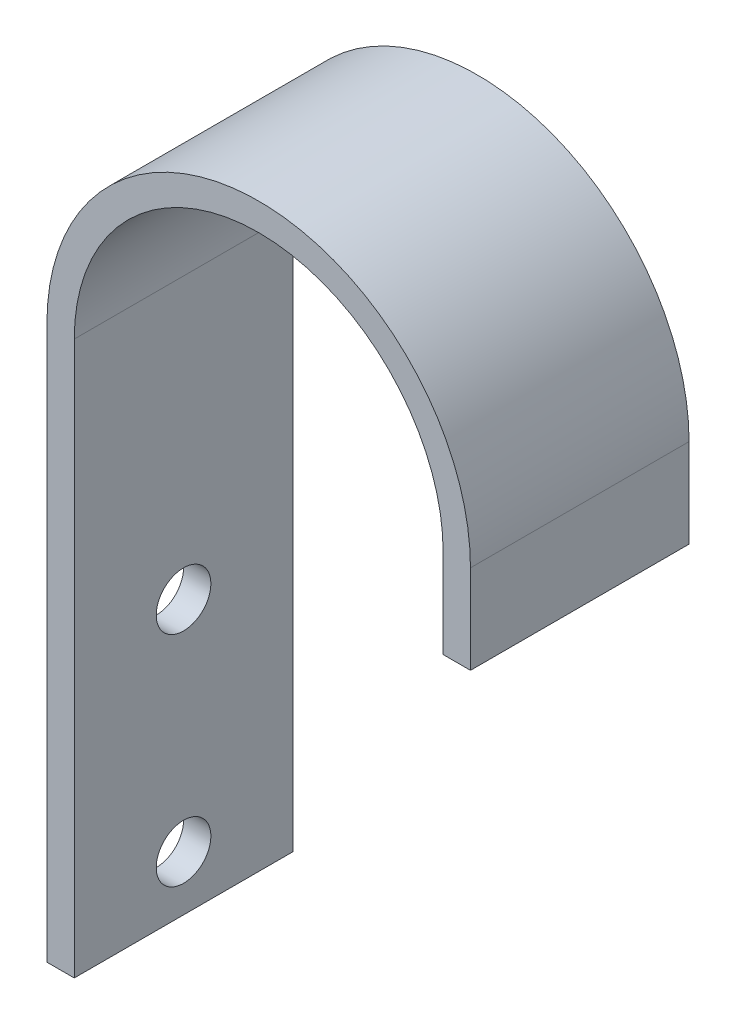
ISO-10303-21;
HEADER;
FILE_DESCRIPTION(('STEP AP214'),'2;1');
FILE_NAME('part.step','',(''),(''),'','','');
FILE_SCHEMA(('AUTOMOTIVE_DESIGN { 1 0 10303 214 1 1 1 1 }'));
ENDSEC;
DATA;
#1=APPLICATION_CONTEXT('core data for automotive mechanical design processes');
#2=APPLICATION_PROTOCOL_DEFINITION('international standard','automotive_design',2000,#1);
#3=PRODUCT_CONTEXT('',#1,'mechanical');
#4=PRODUCT('Part','Part','',(#3));
#5=PRODUCT_RELATED_PRODUCT_CATEGORY('part','',(#4));
#6=PRODUCT_DEFINITION_FORMATION('','',#4);
#7=PRODUCT_DEFINITION_CONTEXT('part definition',#1,'design');
#8=PRODUCT_DEFINITION('design','',#6,#7);
#9=PRODUCT_DEFINITION_SHAPE('','',#8);
#10=(LENGTH_UNIT() NAMED_UNIT(*) SI_UNIT(.MILLI.,.METRE.));
#11=(NAMED_UNIT(*) PLANE_ANGLE_UNIT() SI_UNIT($,.RADIAN.));
#12=(NAMED_UNIT(*) SI_UNIT($,.STERADIAN.) SOLID_ANGLE_UNIT());
#13=UNCERTAINTY_MEASURE_WITH_UNIT(LENGTH_MEASURE(1.E-05),#10,'distance_accuracy_value','');
#14=(GEOMETRIC_REPRESENTATION_CONTEXT(3) GLOBAL_UNCERTAINTY_ASSIGNED_CONTEXT((#13)) GLOBAL_UNIT_ASSIGNED_CONTEXT((#10,
#11,#12)) REPRESENTATION_CONTEXT('',''));
#15=CARTESIAN_POINT('',(0.,0.,0.));
#16=DIRECTION('',(0.,0.,1.));
#17=DIRECTION('',(1.,0.,0.));
#18=AXIS2_PLACEMENT_3D('',#15,#16,#17);
#19=CARTESIAN_POINT('',(-144.426414240362,-31.75,12.7));
#20=DIRECTION('',(1.,0.,0.));
#21=DIRECTION('',(0.,0.,-1.));
#22=AXIS2_PLACEMENT_3D('',#19,#20,#21);
#23=CYLINDRICAL_SURFACE('',#22,3.175);
#24=CARTESIAN_POINT('',(-42.8625,-31.75,12.7));
#25=DIRECTION('',(1.,0.,0.));
#26=DIRECTION('',(0.,0.,-1.));
#27=AXIS2_PLACEMENT_3D('',#24,#25,#26);
#28=CIRCLE('',#27,3.175);
#29=CARTESIAN_POINT('',(-42.8625,-31.75,9.525));
#30=VERTEX_POINT('',#29);
#31=EDGE_CURVE('E142',#30,#30,#28,.T.);
#32=ORIENTED_EDGE('',*,*,#31,.F.);
#33=EDGE_LOOP('',(#32));
#34=FACE_BOUND('',#33,.T.);
#35=CARTESIAN_POINT('',(-39.6875,-31.75,12.7));
#36=DIRECTION('',(1.,0.,0.));
#37=DIRECTION('',(0.,0.,-1.));
#38=AXIS2_PLACEMENT_3D('',#35,#36,#37);
#39=CIRCLE('',#38,3.175);
#40=CARTESIAN_POINT('',(-39.6875,-31.75,9.525));
#41=VERTEX_POINT('',#40);
#42=EDGE_CURVE('E20',#41,#41,#39,.F.);
#43=ORIENTED_EDGE('',*,*,#42,.F.);
#44=EDGE_LOOP('',(#43));
#45=FACE_BOUND('',#44,.T.);
#46=ADVANCED_FACE('F17',(#34,#45),#23,.F.);
#47=CARTESIAN_POINT('',(-144.426414240362,-6.35,12.7));
#48=DIRECTION('',(1.,0.,0.));
#49=DIRECTION('',(0.,0.,-1.));
#50=AXIS2_PLACEMENT_3D('',#47,#48,#49);
#51=CYLINDRICAL_SURFACE('',#50,3.175);
#52=CARTESIAN_POINT('',(-42.8625,-6.35,12.7));
#53=DIRECTION('',(1.,0.,0.));
#54=DIRECTION('',(0.,0.,-1.));
#55=AXIS2_PLACEMENT_3D('',#52,#53,#54);
#56=CIRCLE('',#55,3.175);
#57=CARTESIAN_POINT('',(-42.8625,-6.35,9.525));
#58=VERTEX_POINT('',#57);
#59=EDGE_CURVE('E161',#58,#58,#56,.T.);
#60=ORIENTED_EDGE('',*,*,#59,.F.);
#61=EDGE_LOOP('',(#60));
#62=FACE_BOUND('',#61,.T.);
#63=CARTESIAN_POINT('',(-39.6875,-6.35,12.7));
#64=DIRECTION('',(1.,0.,0.));
#65=DIRECTION('',(0.,0.,-1.));
#66=AXIS2_PLACEMENT_3D('',#63,#64,#65);
#67=CIRCLE('',#66,3.175);
#68=CARTESIAN_POINT('',(-39.6875,-6.35,9.525));
#69=VERTEX_POINT('',#68);
#70=EDGE_CURVE('E130',#69,#69,#67,.F.);
#71=ORIENTED_EDGE('',*,*,#70,.F.);
#72=EDGE_LOOP('',(#71));
#73=FACE_BOUND('',#72,.T.);
#74=ADVANCED_FACE('F175',(#62,#73),#51,.F.);
#75=CARTESIAN_POINT('',(-39.6875,-38.1,0.));
#76=DIRECTION('',(0.,-1.,0.));
#77=DIRECTION('',(0.,0.,-1.));
#78=AXIS2_PLACEMENT_3D('',#75,#76,#77);
#79=PLANE('',#78);
#80=DIRECTION('',(1.,0.,0.));
#81=VECTOR('',#80,1.);
#82=CARTESIAN_POINT('',(-26.533477864469,-38.1,25.4));
#83=LINE('',#82,#81);
#84=CARTESIAN_POINT('',(-42.8625,-38.1,25.4));
#85=VERTEX_POINT('',#84);
#86=CARTESIAN_POINT('',(-39.6875,-38.1,25.4));
#87=VERTEX_POINT('',#86);
#88=EDGE_CURVE('E134',#85,#87,#83,.T.);
#89=ORIENTED_EDGE('',*,*,#88,.F.);
#90=DIRECTION('',(0.,0.,1.));
#91=VECTOR('',#90,1.);
#92=CARTESIAN_POINT('',(-42.8625,-38.1,0.));
#93=LINE('',#92,#91);
#94=CARTESIAN_POINT('',(-42.8625,-38.1,0.));
#95=VERTEX_POINT('',#94);
#96=EDGE_CURVE('E83',#95,#85,#93,.T.);
#97=ORIENTED_EDGE('',*,*,#96,.F.);
#98=DIRECTION('',(1.,0.,0.));
#99=VECTOR('',#98,1.);
#100=CARTESIAN_POINT('',(-26.533477864469,-38.1,0.));
#101=LINE('',#100,#99);
#102=CARTESIAN_POINT('',(-39.6875,-38.1,0.));
#103=VERTEX_POINT('',#102);
#104=EDGE_CURVE('E71',#95,#103,#101,.T.);
#105=ORIENTED_EDGE('',*,*,#104,.T.);
#106=DIRECTION('',(0.,0.,-1.));
#107=VECTOR('',#106,1.);
#108=CARTESIAN_POINT('',(-39.6875,-38.1,0.));
#109=LINE('',#108,#107);
#110=EDGE_CURVE('E77',#87,#103,#109,.T.);
#111=ORIENTED_EDGE('',*,*,#110,.F.);
#112=EDGE_LOOP('',(#89,#97,#105,#111));
#113=FACE_BOUND('',#112,.T.);
#114=ADVANCED_FACE('F181',(#113),#79,.T.);
#115=CARTESIAN_POINT('',(-39.6875,26.19375,0.));
#116=DIRECTION('',(1.,0.,0.));
#117=DIRECTION('',(0.,0.,-1.));
#118=AXIS2_PLACEMENT_3D('',#115,#116,#117);
#119=PLANE('',#118);
#120=ORIENTED_EDGE('',*,*,#70,.T.);
#121=EDGE_LOOP('',(#120));
#122=FACE_BOUND('',#121,.T.);
#123=ORIENTED_EDGE('',*,*,#42,.T.);
#124=EDGE_LOOP('',(#123));
#125=FACE_BOUND('',#124,.T.);
#126=DIRECTION('',(0.,1.,0.));
#127=VECTOR('',#126,1.);
#128=CARTESIAN_POINT('',(-39.6875,17.6760406168869,25.4));
#129=LINE('',#128,#127);
#130=CARTESIAN_POINT('',(-39.6875,26.19375,25.4));
#131=VERTEX_POINT('',#130);
#132=EDGE_CURVE('E137',#87,#131,#129,.T.);
#133=ORIENTED_EDGE('',*,*,#132,.F.);
#134=ORIENTED_EDGE('',*,*,#110,.T.);
#135=DIRECTION('',(0.,1.,0.));
#136=VECTOR('',#135,1.);
#137=CARTESIAN_POINT('',(-39.6875,17.6760406168869,0.));
#138=LINE('',#137,#136);
#139=CARTESIAN_POINT('',(-39.6875,26.19375,0.));
#140=VERTEX_POINT('',#139);
#141=EDGE_CURVE('E61',#103,#140,#138,.T.);
#142=ORIENTED_EDGE('',*,*,#141,.T.);
#143=DIRECTION('',(0.,0.,1.));
#144=VECTOR('',#143,1.);
#145=CARTESIAN_POINT('',(-39.6875,26.19375,0.));
#146=LINE('',#145,#144);
#147=EDGE_CURVE('E128',#140,#131,#146,.T.);
#148=ORIENTED_EDGE('',*,*,#147,.T.);
#149=EDGE_LOOP('',(#133,#134,#142,#148));
#150=FACE_BOUND('',#149,.T.);
#151=ADVANCED_FACE('F172',(#122,#125,#150),#119,.T.);
#152=CARTESIAN_POINT('',(-18.25625,26.19375,0.));
#153=DIRECTION('',(0.,0.,1.));
#154=DIRECTION('',(1.,0.,0.));
#155=AXIS2_PLACEMENT_3D('',#152,#153,#154);
#156=CYLINDRICAL_SURFACE('',#155,21.43125);
#157=CARTESIAN_POINT('',(-18.25625,26.19375,0.));
#158=DIRECTION('',(0.,0.,1.));
#159=DIRECTION('',(1.,0.,0.));
#160=AXIS2_PLACEMENT_3D('',#157,#158,#159);
#161=CIRCLE('',#160,21.43125);
#162=CARTESIAN_POINT('',(3.175,26.19375,0.));
#163=VERTEX_POINT('',#162);
#164=EDGE_CURVE('E105',#140,#163,#161,.F.);
#165=ORIENTED_EDGE('',*,*,#164,.T.);
#166=DIRECTION('',(0.,0.,1.));
#167=VECTOR('',#166,1.);
#168=CARTESIAN_POINT('',(3.175,26.19375,0.));
#169=LINE('',#168,#167);
#170=CARTESIAN_POINT('',(3.175,26.19375,25.4));
#171=VERTEX_POINT('',#170);
#172=EDGE_CURVE('E100',#171,#163,#169,.F.);
#173=ORIENTED_EDGE('',*,*,#172,.F.);
#174=CARTESIAN_POINT('',(-18.25625,26.19375,25.4));
#175=DIRECTION('',(0.,0.,1.));
#176=DIRECTION('',(1.,0.,0.));
#177=AXIS2_PLACEMENT_3D('',#174,#175,#176);
#178=CIRCLE('',#177,21.43125);
#179=EDGE_CURVE('E157',#131,#171,#178,.F.);
#180=ORIENTED_EDGE('',*,*,#179,.F.);
#181=ORIENTED_EDGE('',*,*,#147,.F.);
#182=EDGE_LOOP('',(#165,#173,#180,#181));
#183=FACE_BOUND('',#182,.T.);
#184=ADVANCED_FACE('F208',(#183),#156,.F.);
#185=CARTESIAN_POINT('',(3.175,15.875,0.));
#186=DIRECTION('',(-1.,0.,0.));
#187=DIRECTION('',(0.,0.,1.));
#188=AXIS2_PLACEMENT_3D('',#185,#186,#187);
#189=PLANE('',#188);
#190=DIRECTION('',(0.,1.,0.));
#191=VECTOR('',#190,1.);
#192=CARTESIAN_POINT('',(3.175,17.6760406168869,25.4));
#193=LINE('',#192,#191);
#194=CARTESIAN_POINT('',(3.175,15.875,25.4));
#195=VERTEX_POINT('',#194);
#196=EDGE_CURVE('E160',#171,#195,#193,.F.);
#197=ORIENTED_EDGE('',*,*,#196,.F.);
#198=ORIENTED_EDGE('',*,*,#172,.T.);
#199=DIRECTION('',(0.,1.,0.));
#200=VECTOR('',#199,1.);
#201=CARTESIAN_POINT('',(3.175,17.6760406168869,0.));
#202=LINE('',#201,#200);
#203=CARTESIAN_POINT('',(3.175,15.875,0.));
#204=VERTEX_POINT('',#203);
#205=EDGE_CURVE('E94',#163,#204,#202,.F.);
#206=ORIENTED_EDGE('',*,*,#205,.T.);
#207=DIRECTION('',(0.,0.,-1.));
#208=VECTOR('',#207,1.);
#209=CARTESIAN_POINT('',(3.175,15.875,0.));
#210=LINE('',#209,#208);
#211=EDGE_CURVE('E98',#195,#204,#210,.T.);
#212=ORIENTED_EDGE('',*,*,#211,.F.);
#213=EDGE_LOOP('',(#197,#198,#206,#212));
#214=FACE_BOUND('',#213,.T.);
#215=ADVANCED_FACE('F97',(#214),#189,.T.);
#216=CARTESIAN_POINT('',(6.35,15.875,0.));
#217=DIRECTION('',(0.,-1.,0.));
#218=DIRECTION('',(0.,0.,-1.));
#219=AXIS2_PLACEMENT_3D('',#216,#217,#218);
#220=PLANE('',#219);
#221=DIRECTION('',(1.,0.,0.));
#222=VECTOR('',#221,1.);
#223=CARTESIAN_POINT('',(-26.533477864469,15.875,25.4));
#224=LINE('',#223,#222);
#225=CARTESIAN_POINT('',(6.35,15.875,25.4));
#226=VERTEX_POINT('',#225);
#227=EDGE_CURVE('E111',#195,#226,#224,.T.);
#228=ORIENTED_EDGE('',*,*,#227,.F.);
#229=ORIENTED_EDGE('',*,*,#211,.T.);
#230=DIRECTION('',(1.,0.,0.));
#231=VECTOR('',#230,1.);
#232=CARTESIAN_POINT('',(-26.533477864469,15.875,0.));
#233=LINE('',#232,#231);
#234=CARTESIAN_POINT('',(6.35,15.875,0.));
#235=VERTEX_POINT('',#234);
#236=EDGE_CURVE('E104',#204,#235,#233,.T.);
#237=ORIENTED_EDGE('',*,*,#236,.T.);
#238=DIRECTION('',(0.,0.,-1.));
#239=VECTOR('',#238,1.);
#240=CARTESIAN_POINT('',(6.35,15.875,0.));
#241=LINE('',#240,#239);
#242=EDGE_CURVE('E156',#226,#235,#241,.T.);
#243=ORIENTED_EDGE('',*,*,#242,.F.);
#244=EDGE_LOOP('',(#228,#229,#237,#243));
#245=FACE_BOUND('',#244,.T.);
#246=ADVANCED_FACE('F108',(#245),#220,.T.);
#247=CARTESIAN_POINT('',(-26.533477864469,17.6760406168869,0.));
#248=DIRECTION('',(0.,0.,1.));
#249=DIRECTION('',(1.,0.,0.));
#250=AXIS2_PLACEMENT_3D('',#247,#248,#249);
#251=PLANE('',#250);
#252=DIRECTION('',(0.,1.,0.));
#253=VECTOR('',#252,1.);
#254=CARTESIAN_POINT('',(6.35,26.19375,0.));
#255=LINE('',#254,#253);
#256=CARTESIAN_POINT('',(6.35,26.19375,0.));
#257=VERTEX_POINT('',#256);
#258=EDGE_CURVE('E116',#235,#257,#255,.T.);
#259=ORIENTED_EDGE('',*,*,#258,.F.);
#260=ORIENTED_EDGE('',*,*,#236,.F.);
#261=ORIENTED_EDGE('',*,*,#205,.F.);
#262=ORIENTED_EDGE('',*,*,#164,.F.);
#263=ORIENTED_EDGE('',*,*,#141,.F.);
#264=ORIENTED_EDGE('',*,*,#104,.F.);
#265=DIRECTION('',(0.,1.,0.));
#266=VECTOR('',#265,1.);
#267=CARTESIAN_POINT('',(-42.8625,-38.1,0.));
#268=LINE('',#267,#266);
#269=CARTESIAN_POINT('',(-42.8625,26.19375,0.));
#270=VERTEX_POINT('',#269);
#271=EDGE_CURVE('E118',#270,#95,#268,.F.);
#272=ORIENTED_EDGE('',*,*,#271,.F.);
#273=CARTESIAN_POINT('',(-18.25625,26.19375,0.));
#274=DIRECTION('',(0.,0.,1.));
#275=DIRECTION('',(1.,0.,0.));
#276=AXIS2_PLACEMENT_3D('',#273,#274,#275);
#277=CIRCLE('',#276,24.60625);
#278=EDGE_CURVE('E153',#257,#270,#277,.T.);
#279=ORIENTED_EDGE('',*,*,#278,.F.);
#280=EDGE_LOOP('',(#259,#260,#261,#262,#263,#264,#272,#279));
#281=FACE_BOUND('',#280,.T.);
#282=ADVANCED_FACE('F114',(#281),#251,.F.);
#283=CARTESIAN_POINT('',(-42.8625,-38.1,0.));
#284=DIRECTION('',(-1.,0.,0.));
#285=DIRECTION('',(0.,0.,1.));
#286=AXIS2_PLACEMENT_3D('',#283,#284,#285);
#287=PLANE('',#286);
#288=ORIENTED_EDGE('',*,*,#59,.T.);
#289=EDGE_LOOP('',(#288));
#290=FACE_BOUND('',#289,.T.);
#291=ORIENTED_EDGE('',*,*,#31,.T.);
#292=EDGE_LOOP('',(#291));
#293=FACE_BOUND('',#292,.T.);
#294=DIRECTION('',(0.,1.,0.));
#295=VECTOR('',#294,1.);
#296=CARTESIAN_POINT('',(-42.8625,17.6760406168869,25.4));
#297=LINE('',#296,#295);
#298=CARTESIAN_POINT('',(-42.8625,26.19375,25.4));
#299=VERTEX_POINT('',#298);
#300=EDGE_CURVE('E138',#299,#85,#297,.F.);
#301=ORIENTED_EDGE('',*,*,#300,.F.);
#302=DIRECTION('',(0.,0.,1.));
#303=VECTOR('',#302,1.);
#304=CARTESIAN_POINT('',(-42.8625,26.19375,0.));
#305=LINE('',#304,#303);
#306=EDGE_CURVE('E152',#270,#299,#305,.T.);
#307=ORIENTED_EDGE('',*,*,#306,.F.);
#308=ORIENTED_EDGE('',*,*,#271,.T.);
#309=ORIENTED_EDGE('',*,*,#96,.T.);
#310=EDGE_LOOP('',(#301,#307,#308,#309));
#311=FACE_BOUND('',#310,.T.);
#312=ADVANCED_FACE('F198',(#290,#293,#311),#287,.T.);
#313=CARTESIAN_POINT('',(-26.533477864469,17.6760406168869,25.4));
#314=DIRECTION('',(0.,0.,1.));
#315=DIRECTION('',(1.,0.,0.));
#316=AXIS2_PLACEMENT_3D('',#313,#314,#315);
#317=PLANE('',#316);
#318=ORIENTED_EDGE('',*,*,#179,.T.);
#319=ORIENTED_EDGE('',*,*,#196,.T.);
#320=ORIENTED_EDGE('',*,*,#227,.T.);
#321=DIRECTION('',(0.,1.,0.));
#322=VECTOR('',#321,1.);
#323=CARTESIAN_POINT('',(6.35,26.19375,25.4));
#324=LINE('',#323,#322);
#325=CARTESIAN_POINT('',(6.35,26.19375,25.4));
#326=VERTEX_POINT('',#325);
#327=EDGE_CURVE('E35',#326,#226,#324,.F.);
#328=ORIENTED_EDGE('',*,*,#327,.F.);
#329=CARTESIAN_POINT('',(-18.25625,26.19375,25.4));
#330=DIRECTION('',(0.,0.,1.));
#331=DIRECTION('',(1.,0.,0.));
#332=AXIS2_PLACEMENT_3D('',#329,#330,#331);
#333=CIRCLE('',#332,24.60625);
#334=EDGE_CURVE('E26',#299,#326,#333,.F.);
#335=ORIENTED_EDGE('',*,*,#334,.F.);
#336=ORIENTED_EDGE('',*,*,#300,.T.);
#337=ORIENTED_EDGE('',*,*,#88,.T.);
#338=ORIENTED_EDGE('',*,*,#132,.T.);
#339=EDGE_LOOP('',(#318,#319,#320,#328,#335,#336,#337,#338));
#340=FACE_BOUND('',#339,.T.);
#341=ADVANCED_FACE('F192',(#340),#317,.T.);
#342=CARTESIAN_POINT('',(6.35,26.19375,0.));
#343=DIRECTION('',(1.,0.,0.));
#344=DIRECTION('',(0.,0.,-1.));
#345=AXIS2_PLACEMENT_3D('',#342,#343,#344);
#346=PLANE('',#345);
#347=ORIENTED_EDGE('',*,*,#327,.T.);
#348=ORIENTED_EDGE('',*,*,#242,.T.);
#349=ORIENTED_EDGE('',*,*,#258,.T.);
#350=DIRECTION('',(0.,0.,1.));
#351=VECTOR('',#350,1.);
#352=CARTESIAN_POINT('',(6.35,26.19375,0.));
#353=LINE('',#352,#351);
#354=EDGE_CURVE('E11',#326,#257,#353,.F.);
#355=ORIENTED_EDGE('',*,*,#354,.F.);
#356=EDGE_LOOP('',(#347,#348,#349,#355));
#357=FACE_BOUND('',#356,.T.);
#358=ADVANCED_FACE('F186',(#357),#346,.T.);
#359=CARTESIAN_POINT('',(-18.25625,26.19375,0.));
#360=DIRECTION('',(0.,0.,1.));
#361=DIRECTION('',(1.,0.,0.));
#362=AXIS2_PLACEMENT_3D('',#359,#360,#361);
#363=CYLINDRICAL_SURFACE('',#362,24.60625);
#364=ORIENTED_EDGE('',*,*,#334,.T.);
#365=ORIENTED_EDGE('',*,*,#354,.T.);
#366=ORIENTED_EDGE('',*,*,#278,.T.);
#367=ORIENTED_EDGE('',*,*,#306,.T.);
#368=EDGE_LOOP('',(#364,#365,#366,#367));
#369=FACE_BOUND('',#368,.T.);
#370=ADVANCED_FACE('F184',(#369),#363,.T.);
#371=CLOSED_SHELL('',(#46,#74,#114,#151,#184,#215,#246,#282,#312,#341,#358,#370));
#372=MANIFOLD_SOLID_BREP('B1',#371);
#373=ADVANCED_BREP_SHAPE_REPRESENTATION('',(#18,#372),#14);
#374=SHAPE_DEFINITION_REPRESENTATION(#9,#373);
ENDSEC;
END-ISO-10303-21;
